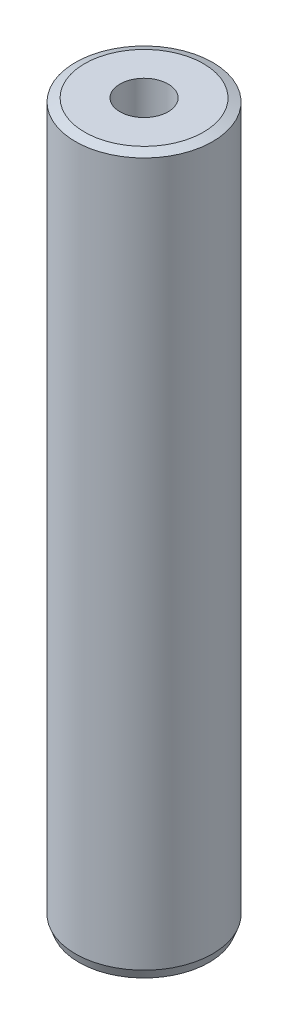
ISO-10303-21;
HEADER;
FILE_DESCRIPTION(('STEP AP214'),'2;1');
FILE_NAME('part.step','',(''),(''),'','','');
FILE_SCHEMA(('AUTOMOTIVE_DESIGN { 1 0 10303 214 1 1 1 1 }'));
ENDSEC;
DATA;
#1=APPLICATION_CONTEXT('core data for automotive mechanical design processes');
#2=APPLICATION_PROTOCOL_DEFINITION('international standard','automotive_design',2000,#1);
#3=PRODUCT_CONTEXT('',#1,'mechanical');
#4=PRODUCT('Part','Part','',(#3));
#5=PRODUCT_RELATED_PRODUCT_CATEGORY('part','',(#4));
#6=PRODUCT_DEFINITION_FORMATION('','',#4);
#7=PRODUCT_DEFINITION_CONTEXT('part definition',#1,'design');
#8=PRODUCT_DEFINITION('design','',#6,#7);
#9=PRODUCT_DEFINITION_SHAPE('','',#8);
#10=(LENGTH_UNIT() NAMED_UNIT(*) SI_UNIT(.MILLI.,.METRE.));
#11=(NAMED_UNIT(*) PLANE_ANGLE_UNIT() SI_UNIT($,.RADIAN.));
#12=(NAMED_UNIT(*) SI_UNIT($,.STERADIAN.) SOLID_ANGLE_UNIT());
#13=UNCERTAINTY_MEASURE_WITH_UNIT(LENGTH_MEASURE(1.E-05),#10,'distance_accuracy_value','');
#14=(GEOMETRIC_REPRESENTATION_CONTEXT(3) GLOBAL_UNCERTAINTY_ASSIGNED_CONTEXT((#13)) GLOBAL_UNIT_ASSIGNED_CONTEXT((#10,
#11,#12)) REPRESENTATION_CONTEXT('',''));
#15=CARTESIAN_POINT('',(0.,0.,0.));
#16=DIRECTION('',(0.,0.,1.));
#17=DIRECTION('',(1.,0.,0.));
#18=AXIS2_PLACEMENT_3D('',#15,#16,#17);
#19=CARTESIAN_POINT('',(0.,600.,0.));
#20=DIRECTION('',(0.,-1.,0.));
#21=DIRECTION('',(0.,0.,-1.));
#22=AXIS2_PLACEMENT_3D('',#19,#20,#21);
#23=CYLINDRICAL_SURFACE('',#22,57.5);
#24=CARTESIAN_POINT('',(0.,597.036804562232,0.));
#25=DIRECTION('',(0.,1.,0.));
#26=DIRECTION('',(0.,0.,1.));
#27=AXIS2_PLACEMENT_3D('',#24,#25,#26);
#28=CIRCLE('',#27,57.5);
#29=CARTESIAN_POINT('',(0.,597.036804562232,-57.5000000000001));
#30=VERTEX_POINT('',#29);
#31=EDGE_CURVE('E50',#30,#30,#28,.F.);
#32=ORIENTED_EDGE('',*,*,#31,.T.);
#33=EDGE_LOOP('',(#32));
#34=FACE_BOUND('',#33,.T.);
#35=CARTESIAN_POINT('',(0.,7.74621618104554,0.));
#36=DIRECTION('',(0.,1.,0.));
#37=DIRECTION('',(0.,0.,1.));
#38=AXIS2_PLACEMENT_3D('',#35,#36,#37);
#39=CIRCLE('',#38,57.5);
#40=CARTESIAN_POINT('',(0.,7.74621618104554,57.5));
#41=VERTEX_POINT('',#40);
#42=EDGE_CURVE('E51',#41,#41,#39,.T.);
#43=ORIENTED_EDGE('',*,*,#42,.T.);
#44=EDGE_LOOP('',(#43));
#45=FACE_BOUND('',#44,.T.);
#46=ADVANCED_FACE('F39',(#34,#45),#23,.T.);
#47=CARTESIAN_POINT('',(0.,600.,0.));
#48=DIRECTION('',(0.,1.,0.));
#49=DIRECTION('',(0.,0.,1.));
#50=AXIS2_PLACEMENT_3D('',#47,#48,#49);
#51=PLANE('',#50);
#52=CARTESIAN_POINT('',(0.,600.,0.));
#53=DIRECTION('',(0.,1.,0.));
#54=DIRECTION('',(0.,0.,1.));
#55=AXIS2_PLACEMENT_3D('',#52,#53,#54);
#56=CIRCLE('',#55,49.7537838189546);
#57=CARTESIAN_POINT('',(0.,600.,-49.7537838189547));
#58=VERTEX_POINT('',#57);
#59=EDGE_CURVE('E54',#58,#58,#56,.T.);
#60=ORIENTED_EDGE('',*,*,#59,.T.);
#61=EDGE_LOOP('',(#60));
#62=FACE_BOUND('',#61,.T.);
#63=CARTESIAN_POINT('',(0.,600.,0.));
#64=DIRECTION('',(0.,1.,0.));
#65=DIRECTION('',(0.,0.,1.));
#66=AXIS2_PLACEMENT_3D('',#63,#64,#65);
#67=CIRCLE('',#66,20.1871404970523);
#68=CARTESIAN_POINT('',(0.,600.,20.1871404970523));
#69=VERTEX_POINT('',#68);
#70=EDGE_CURVE('E58',#69,#69,#67,.T.);
#71=ORIENTED_EDGE('',*,*,#70,.F.);
#72=EDGE_LOOP('',(#71));
#73=FACE_BOUND('',#72,.T.);
#74=ADVANCED_FACE('F69',(#62,#73),#51,.T.);
#75=CARTESIAN_POINT('',(0.,0.,0.));
#76=DIRECTION('',(0.,1.,0.));
#77=DIRECTION('',(0.,0.,1.));
#78=AXIS2_PLACEMENT_3D('',#75,#76,#77);
#79=PLANE('',#78);
#80=CARTESIAN_POINT('',(0.,0.,0.));
#81=DIRECTION('',(0.,1.,0.));
#82=DIRECTION('',(0.,0.,1.));
#83=AXIS2_PLACEMENT_3D('',#80,#81,#82);
#84=CIRCLE('',#83,54.5368045622316);
#85=CARTESIAN_POINT('',(0.,0.,54.5368045622316));
#86=VERTEX_POINT('',#85);
#87=EDGE_CURVE('E10',#86,#86,#84,.F.);
#88=ORIENTED_EDGE('',*,*,#87,.T.);
#89=EDGE_LOOP('',(#88));
#90=FACE_BOUND('',#89,.T.);
#91=CARTESIAN_POINT('',(0.,0.,0.));
#92=DIRECTION('',(0.,1.,0.));
#93=DIRECTION('',(0.,0.,1.));
#94=AXIS2_PLACEMENT_3D('',#91,#92,#93);
#95=CIRCLE('',#94,20.1871404970523);
#96=CARTESIAN_POINT('',(0.,0.,20.1871404970523));
#97=VERTEX_POINT('',#96);
#98=EDGE_CURVE('E63',#97,#97,#95,.T.);
#99=ORIENTED_EDGE('',*,*,#98,.T.);
#100=EDGE_LOOP('',(#99));
#101=FACE_BOUND('',#100,.T.);
#102=ADVANCED_FACE('F75',(#90,#101),#79,.F.);
#103=CARTESIAN_POINT('',(0.,600.,0.));
#104=DIRECTION('',(0.,-1.,0.));
#105=DIRECTION('',(0.,0.,-1.));
#106=AXIS2_PLACEMENT_3D('',#103,#104,#105);
#107=CYLINDRICAL_SURFACE('',#106,20.1871404970523);
#108=ORIENTED_EDGE('',*,*,#70,.T.);
#109=EDGE_LOOP('',(#108));
#110=FACE_BOUND('',#109,.T.);
#111=ORIENTED_EDGE('',*,*,#98,.F.);
#112=EDGE_LOOP('',(#111));
#113=FACE_BOUND('',#112,.T.);
#114=ADVANCED_FACE('F70',(#110,#113),#107,.F.);
#115=CARTESIAN_POINT('',(0.,600.,0.));
#116=DIRECTION('',(0.,-1.,0.));
#117=DIRECTION('',(0.,0.,-1.));
#118=AXIS2_PLACEMENT_3D('',#115,#116,#117);
#119=CONICAL_SURFACE('',#118,49.7537838189546,1.20543642832647);
#120=CARTESIAN_POINT('',(0.,597.036804562232,-57.5000000000001));
#121=CARTESIAN_POINT('',(0.,597.067671181375,-57.4193102481143));
#122=CARTESIAN_POINT('',(0.,597.098537800518,-57.3386204962284));
#123=CARTESIAN_POINT('',(0.,597.160271038805,-57.1772409924566));
#124=CARTESIAN_POINT('',(0.,597.191137657949,-57.0965512405707));
#125=CARTESIAN_POINT('',(0.,597.252870896235,-56.9351717367989));
#126=CARTESIAN_POINT('',(0.,597.283737515379,-56.854481984913));
#127=CARTESIAN_POINT('',(0.,597.345470753666,-56.6931024811413));
#128=CARTESIAN_POINT('',(0.,597.376337372809,-56.6124127292554));
#129=CARTESIAN_POINT('',(0.,597.438070611096,-56.4510332254836));
#130=CARTESIAN_POINT('',(0.,597.468937230239,-56.3703434735977));
#131=CARTESIAN_POINT('',(0.,597.530670468526,-56.2089639698259));
#132=CARTESIAN_POINT('',(0.,597.56153708767,-56.12827421794));
#133=CARTESIAN_POINT('',(0.,597.623270325956,-55.9668947141682));
#134=CARTESIAN_POINT('',(0.,597.6541369451,-55.8862049622823));
#135=CARTESIAN_POINT('',(0.,597.715870183387,-55.7248254585106));
#136=CARTESIAN_POINT('',(0.,597.74673680253,-55.6441357066247));
#137=CARTESIAN_POINT('',(0.,597.808470040817,-55.4827562028529));
#138=CARTESIAN_POINT('',(0.,597.839336659961,-55.402066450967));
#139=CARTESIAN_POINT('',(0.,597.901069898247,-55.2406869471952));
#140=CARTESIAN_POINT('',(0.,597.931936517391,-55.1599971953093));
#141=CARTESIAN_POINT('',(0.,597.993669755678,-54.9986176915376));
#142=CARTESIAN_POINT('',(0.,598.024536374821,-54.9179279396517));
#143=CARTESIAN_POINT('',(0.,598.086269613108,-54.7565484358799));
#144=CARTESIAN_POINT('',(0.,598.117136232251,-54.675858683994));
#145=CARTESIAN_POINT('',(0.,598.178869470538,-54.5144791802222));
#146=CARTESIAN_POINT('',(0.,598.209736089682,-54.4337894283363));
#147=CARTESIAN_POINT('',(0.,598.271469327968,-54.2724099245645));
#148=CARTESIAN_POINT('',(0.,598.302335947112,-54.1917201726787));
#149=CARTESIAN_POINT('',(0.,598.364069185399,-54.0303406689069));
#150=CARTESIAN_POINT('',(0.,598.394935804542,-53.949650917021));
#151=CARTESIAN_POINT('',(0.,598.456669042829,-53.7882714132492));
#152=CARTESIAN_POINT('',(0.,598.487535661972,-53.7075816613633));
#153=CARTESIAN_POINT('',(0.,598.549268900259,-53.5462021575915));
#154=CARTESIAN_POINT('',(0.,598.580135519403,-53.4655124057057));
#155=CARTESIAN_POINT('',(0.,598.641868757689,-53.3041329019339));
#156=CARTESIAN_POINT('',(0.,598.672735376833,-53.223443150048));
#157=CARTESIAN_POINT('',(0.,598.73446861512,-53.0620636462762));
#158=CARTESIAN_POINT('',(0.,598.765335234263,-52.9813738943903));
#159=CARTESIAN_POINT('',(0.,598.82706847255,-52.8199943906185));
#160=CARTESIAN_POINT('',(0.,598.857935091693,-52.7393046387326));
#161=CARTESIAN_POINT('',(0.,598.91966832998,-52.5779251349609));
#162=CARTESIAN_POINT('',(0.,598.950534949124,-52.497235383075));
#163=CARTESIAN_POINT('',(0.,599.012268187411,-52.3358558793032));
#164=CARTESIAN_POINT('',(0.,599.043134806554,-52.2551661274173));
#165=CARTESIAN_POINT('',(0.,599.104868044841,-52.0937866236455));
#166=CARTESIAN_POINT('',(0.,599.135734663984,-52.0130968717596));
#167=CARTESIAN_POINT('',(0.,599.197467902271,-51.8517173679879));
#168=CARTESIAN_POINT('',(0.,599.228334521414,-51.771027616102));
#169=CARTESIAN_POINT('',(0.,599.290067759701,-51.6096481123302));
#170=CARTESIAN_POINT('',(0.,599.320934378845,-51.5289583604443));
#171=CARTESIAN_POINT('',(0.,599.382667617132,-51.3675788566725));
#172=CARTESIAN_POINT('',(0.,599.413534236275,-51.2868891047866));
#173=CARTESIAN_POINT('',(0.,599.475267474562,-51.1255096010148));
#174=CARTESIAN_POINT('',(0.,599.506134093705,-51.044819849129));
#175=CARTESIAN_POINT('',(0.,599.567867331992,-50.8834403453572));
#176=CARTESIAN_POINT('',(0.,599.598733951136,-50.8027505934713));
#177=CARTESIAN_POINT('',(0.,599.660467189422,-50.6413710896995));
#178=CARTESIAN_POINT('',(0.,599.691333808566,-50.5606813378136));
#179=CARTESIAN_POINT('',(0.,599.753067046853,-50.3993018340418));
#180=CARTESIAN_POINT('',(0.,599.783933665996,-50.3186120821559));
#181=CARTESIAN_POINT('',(0.,599.845666904283,-50.1572325783842));
#182=CARTESIAN_POINT('',(0.,599.876533523426,-50.0765428264983));
#183=CARTESIAN_POINT('',(0.,599.938266761713,-49.9151633227265));
#184=CARTESIAN_POINT('',(0.,599.969133380857,-49.8344735708406));
#185=CARTESIAN_POINT('',(0.,600.,-49.7537838189547));
#186=B_SPLINE_CURVE_WITH_KNOTS('',3,(#120,#121,#122,#123,#124,#125,#126,#127,#128,#129,#130,
#131,#132,#133,#134,#135,#136,#137,#138,#139,#140,#141,#142,#143,#144,#145,#146,#147,#148,#149,
#150,#151,#152,#153,#154,#155,#156,#157,#158,#159,#160,#161,#162,#163,#164,#165,#166,#167,#168,
#169,#170,#171,#172,#173,#174,#175,#176,#177,#178,#179,#180,#181,#182,#183,#184,#185),
.UNSPECIFIED.,.F.,.F.,(4,2,2,2,2,2,2,2,2,2,2,2,2,2,2,2,2,2,2,2,2,2,2,2,2,2,2,2,2,2,2,2,4),(0.,
0.259176114120808,0.518352228241622,0.777528342362429,1.03670445648324,1.29588057060406,
1.55505668472486,1.81423279884568,2.07340891296649,2.3325850270873,2.59176114120811,
2.85093725532892,3.11011336944973,3.36928948357054,3.62846559769135,3.88764171181216,
4.14681782593297,4.40599394005379,4.6651700541746,4.92434616829541,5.18352228241622,
5.44269839653703,5.70187451065784,5.96105062477865,6.22022673889946,6.47940285302027,
6.73857896714109,6.99775508126189,7.25693119538271,7.51610730950352,7.77528342362433,
8.03445953774514,8.29363565186595),.UNSPECIFIED.);
#187=EDGE_CURVE('BSEAM81',#30,#58,#186,.T.);
#188=ORIENTED_EDGE('',*,*,#31,.F.);
#189=ORIENTED_EDGE('',*,*,#59,.F.);
#190=ORIENTED_EDGE('',*,*,#187,.T.);
#191=ORIENTED_EDGE('',*,*,#187,.F.);
#192=EDGE_LOOP('',(#188,#190,#189,#191));
#193=FACE_BOUND('',#192,.T.);
#194=ADVANCED_FACE('F81',(#193),#119,.T.);
#195=CARTESIAN_POINT('',(0.,7.74621618104554,0.));
#196=DIRECTION('',(0.,1.,0.));
#197=DIRECTION('',(0.,0.,1.));
#198=AXIS2_PLACEMENT_3D('',#195,#196,#197);
#199=CONICAL_SURFACE('',#198,57.5,0.365359898468424);
#200=ORIENTED_EDGE('',*,*,#87,.F.);
#201=EDGE_LOOP('',(#200));
#202=FACE_BOUND('',#201,.T.);
#203=ORIENTED_EDGE('',*,*,#42,.F.);
#204=EDGE_LOOP('',(#203));
#205=FACE_BOUND('',#204,.T.);
#206=ADVANCED_FACE('F45',(#202,#205),#199,.T.);
#207=CLOSED_SHELL('',(#46,#74,#102,#114,#194,#206));
#208=MANIFOLD_SOLID_BREP('B2',#207);
#209=ADVANCED_BREP_SHAPE_REPRESENTATION('',(#18,#208),#14);
#210=SHAPE_DEFINITION_REPRESENTATION(#9,#209);
ENDSEC;
END-ISO-10303-21;
